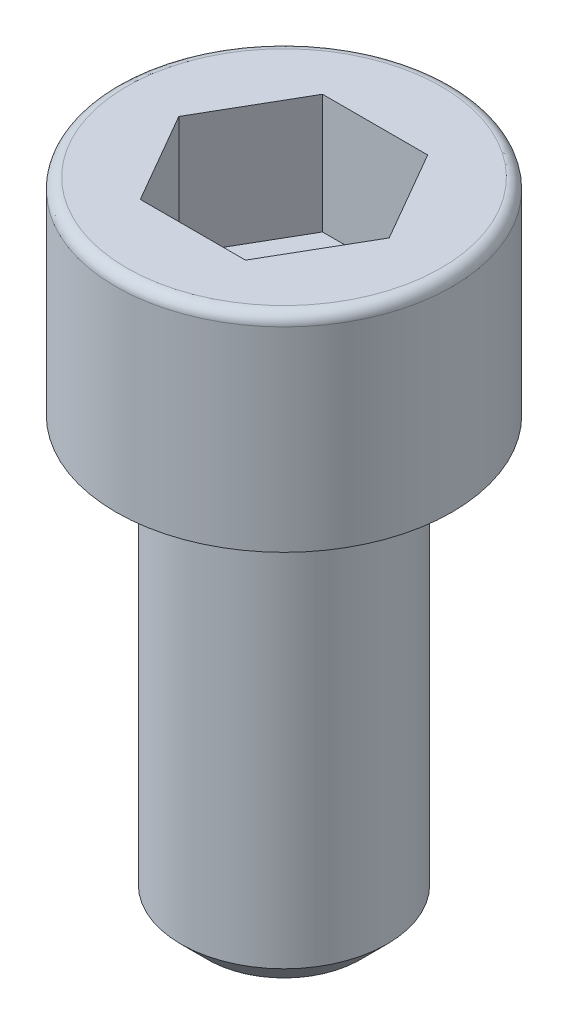
ISO-10303-21;
HEADER;
FILE_DESCRIPTION(('STEP AP214'),'2;1');
FILE_NAME('part.step','',(''),(''),'','','');
FILE_SCHEMA(('AUTOMOTIVE_DESIGN { 1 0 10303 214 1 1 1 1 }'));
ENDSEC;
DATA;
#1=APPLICATION_CONTEXT('core data for automotive mechanical design processes');
#2=APPLICATION_PROTOCOL_DEFINITION('international standard','automotive_design',2000,#1);
#3=PRODUCT_CONTEXT('',#1,'mechanical');
#4=PRODUCT('Part','Part','',(#3));
#5=PRODUCT_RELATED_PRODUCT_CATEGORY('part','',(#4));
#6=PRODUCT_DEFINITION_FORMATION('','',#4);
#7=PRODUCT_DEFINITION_CONTEXT('part definition',#1,'design');
#8=PRODUCT_DEFINITION('design','',#6,#7);
#9=PRODUCT_DEFINITION_SHAPE('','',#8);
#10=(LENGTH_UNIT() NAMED_UNIT(*) SI_UNIT(.MILLI.,.METRE.));
#11=(NAMED_UNIT(*) PLANE_ANGLE_UNIT() SI_UNIT($,.RADIAN.));
#12=(NAMED_UNIT(*) SI_UNIT($,.STERADIAN.) SOLID_ANGLE_UNIT());
#13=UNCERTAINTY_MEASURE_WITH_UNIT(LENGTH_MEASURE(1.E-05),#10,'distance_accuracy_value','');
#14=(GEOMETRIC_REPRESENTATION_CONTEXT(3) GLOBAL_UNCERTAINTY_ASSIGNED_CONTEXT((#13)) GLOBAL_UNIT_ASSIGNED_CONTEXT((#10,
#11,#12)) REPRESENTATION_CONTEXT('',''));
#15=CARTESIAN_POINT('',(0.,0.,0.));
#16=DIRECTION('',(0.,0.,1.));
#17=DIRECTION('',(1.,0.,0.));
#18=AXIS2_PLACEMENT_3D('',#15,#16,#17);
#19=CARTESIAN_POINT('',(0.,-10.,0.));
#20=DIRECTION('',(0.,1.,0.));
#21=DIRECTION('',(0.,0.,1.));
#22=AXIS2_PLACEMENT_3D('',#19,#20,#21);
#23=CYLINDRICAL_SURFACE('',#22,2.375);
#24=CARTESIAN_POINT('',(0.,0.,0.));
#25=DIRECTION('',(0.,-1.,0.));
#26=DIRECTION('',(0.,0.,-1.));
#27=AXIS2_PLACEMENT_3D('',#24,#25,#26);
#28=CIRCLE('',#27,2.375);
#29=CARTESIAN_POINT('',(0.,0.,-2.375));
#30=VERTEX_POINT('',#29);
#31=EDGE_CURVE('E11',#30,#30,#28,.T.);
#32=ORIENTED_EDGE('',*,*,#31,.T.);
#33=EDGE_LOOP('',(#32));
#34=FACE_BOUND('',#33,.T.);
#35=CARTESIAN_POINT('',(0.,-9.37500000000001,0.));
#36=DIRECTION('',(0.,-1.,0.));
#37=DIRECTION('',(0.,0.,-1.));
#38=AXIS2_PLACEMENT_3D('',#35,#36,#37);
#39=CIRCLE('',#38,2.375);
#40=CARTESIAN_POINT('',(0.,-9.37500000000001,-2.375));
#41=VERTEX_POINT('',#40);
#42=EDGE_CURVE('E206',#41,#41,#39,.T.);
#43=ORIENTED_EDGE('',*,*,#42,.F.);
#44=EDGE_LOOP('',(#43));
#45=FACE_BOUND('',#44,.T.);
#46=ADVANCED_FACE('F33',(#34,#45),#23,.T.);
#47=CARTESIAN_POINT('',(0.,4.75,0.));
#48=DIRECTION('',(0.,-1.,0.));
#49=DIRECTION('',(0.,0.,-1.));
#50=AXIS2_PLACEMENT_3D('',#47,#48,#49);
#51=CYLINDRICAL_SURFACE('',#50,3.875);
#52=CARTESIAN_POINT('',(0.,4.5,0.));
#53=DIRECTION('',(0.,1.,0.));
#54=DIRECTION('',(0.,0.,1.));
#55=AXIS2_PLACEMENT_3D('',#52,#53,#54);
#56=CIRCLE('',#55,3.875);
#57=CARTESIAN_POINT('',(0.,4.5,3.875));
#58=VERTEX_POINT('',#57);
#59=EDGE_CURVE('E37',#58,#58,#56,.F.);
#60=ORIENTED_EDGE('',*,*,#59,.T.);
#61=EDGE_LOOP('',(#60));
#62=FACE_BOUND('',#61,.T.);
#63=CARTESIAN_POINT('',(0.,0.,0.));
#64=DIRECTION('',(0.,1.,0.));
#65=DIRECTION('',(0.,0.,1.));
#66=AXIS2_PLACEMENT_3D('',#63,#64,#65);
#67=CIRCLE('',#66,3.875);
#68=CARTESIAN_POINT('',(0.,0.,3.875));
#69=VERTEX_POINT('',#68);
#70=EDGE_CURVE('E137',#69,#69,#67,.T.);
#71=ORIENTED_EDGE('',*,*,#70,.T.);
#72=EDGE_LOOP('',(#71));
#73=FACE_BOUND('',#72,.T.);
#74=ADVANCED_FACE('F151',(#62,#73),#51,.T.);
#75=CARTESIAN_POINT('',(0.,4.75,0.));
#76=DIRECTION('',(0.,1.,0.));
#77=DIRECTION('',(0.,0.,1.));
#78=AXIS2_PLACEMENT_3D('',#75,#76,#77);
#79=PLANE('',#78);
#80=DIRECTION('',(-1.,0.,0.));
#81=VECTOR('',#80,1.);
#82=CARTESIAN_POINT('',(0.,4.75,-2.1));
#83=LINE('',#82,#81);
#84=CARTESIAN_POINT('',(1.21243556529821,4.75,-2.1));
#85=VERTEX_POINT('',#84);
#86=CARTESIAN_POINT('',(-1.21243556529821,4.75,-2.1));
#87=VERTEX_POINT('',#86);
#88=EDGE_CURVE('E49',#85,#87,#83,.T.);
#89=ORIENTED_EDGE('',*,*,#88,.F.);
#90=DIRECTION('',(-0.5,0.,-0.866025403784439));
#91=VECTOR('',#90,1.);
#92=CARTESIAN_POINT('',(1.81865334794732,4.75,-1.05));
#93=LINE('',#92,#91);
#94=CARTESIAN_POINT('',(2.42487113059643,4.75,0.));
#95=VERTEX_POINT('',#94);
#96=EDGE_CURVE('E133',#95,#85,#93,.T.);
#97=ORIENTED_EDGE('',*,*,#96,.F.);
#98=DIRECTION('',(0.5,0.,-0.866025403784439));
#99=VECTOR('',#98,1.);
#100=CARTESIAN_POINT('',(1.81865334794732,4.75,1.05));
#101=LINE('',#100,#99);
#102=CARTESIAN_POINT('',(1.21243556529821,4.75,2.1));
#103=VERTEX_POINT('',#102);
#104=EDGE_CURVE('E131',#103,#95,#101,.T.);
#105=ORIENTED_EDGE('',*,*,#104,.F.);
#106=DIRECTION('',(1.,0.,0.));
#107=VECTOR('',#106,1.);
#108=CARTESIAN_POINT('',(0.,4.75,2.1));
#109=LINE('',#108,#107);
#110=CARTESIAN_POINT('',(-1.21243556529822,4.75,2.1));
#111=VERTEX_POINT('',#110);
#112=EDGE_CURVE('E97',#111,#103,#109,.T.);
#113=ORIENTED_EDGE('',*,*,#112,.F.);
#114=DIRECTION('',(0.5,0.,0.866025403784439));
#115=VECTOR('',#114,1.);
#116=CARTESIAN_POINT('',(-1.81865334794732,4.75,1.05));
#117=LINE('',#116,#115);
#118=CARTESIAN_POINT('',(-2.42487113059643,4.75,0.));
#119=VERTEX_POINT('',#118);
#120=EDGE_CURVE('E127',#119,#111,#117,.T.);
#121=ORIENTED_EDGE('',*,*,#120,.F.);
#122=DIRECTION('',(-0.5,0.,0.866025403784439));
#123=VECTOR('',#122,1.);
#124=CARTESIAN_POINT('',(-1.81865334794732,4.75,-1.05));
#125=LINE('',#124,#123);
#126=EDGE_CURVE('E123',#87,#119,#125,.T.);
#127=ORIENTED_EDGE('',*,*,#126,.F.);
#128=EDGE_LOOP('',(#89,#97,#105,#113,#121,#127));
#129=FACE_BOUND('',#128,.T.);
#130=CARTESIAN_POINT('',(0.,4.75,0.));
#131=DIRECTION('',(0.,1.,0.));
#132=DIRECTION('',(0.,0.,1.));
#133=AXIS2_PLACEMENT_3D('',#130,#131,#132);
#134=CIRCLE('',#133,3.625);
#135=CARTESIAN_POINT('',(0.,4.75,3.625));
#136=VERTEX_POINT('',#135);
#137=EDGE_CURVE('E144',#136,#136,#134,.T.);
#138=ORIENTED_EDGE('',*,*,#137,.T.);
#139=EDGE_LOOP('',(#138));
#140=FACE_BOUND('',#139,.T.);
#141=ADVANCED_FACE('F164',(#129,#140),#79,.T.);
#142=CARTESIAN_POINT('',(0.,0.,0.));
#143=DIRECTION('',(0.,1.,0.));
#144=DIRECTION('',(0.,0.,1.));
#145=AXIS2_PLACEMENT_3D('',#142,#143,#144);
#146=PLANE('',#145);
#147=ORIENTED_EDGE('',*,*,#31,.F.);
#148=EDGE_LOOP('',(#147));
#149=FACE_BOUND('',#148,.T.);
#150=ORIENTED_EDGE('',*,*,#70,.F.);
#151=EDGE_LOOP('',(#150));
#152=FACE_BOUND('',#151,.T.);
#153=ADVANCED_FACE('F157',(#149,#152),#146,.F.);
#154=CARTESIAN_POINT('',(0.,4.5,0.));
#155=DIRECTION('',(0.,1.,0.));
#156=DIRECTION('',(0.,0.,1.));
#157=AXIS2_PLACEMENT_3D('',#154,#155,#156);
#158=TOROIDAL_SURFACE('',#157,3.625,0.25);
#159=ORIENTED_EDGE('',*,*,#59,.F.);
#160=EDGE_LOOP('',(#159));
#161=FACE_BOUND('',#160,.T.);
#162=ORIENTED_EDGE('',*,*,#137,.F.);
#163=EDGE_LOOP('',(#162));
#164=FACE_BOUND('',#163,.T.);
#165=ADVANCED_FACE('F35',(#161,#164),#158,.T.);
#166=CARTESIAN_POINT('',(0.,2.,-2.1));
#167=DIRECTION('',(0.,0.,-1.));
#168=DIRECTION('',(-1.,0.,0.));
#169=AXIS2_PLACEMENT_3D('',#166,#167,#168);
#170=PLANE('',#169);
#171=ORIENTED_EDGE('',*,*,#88,.T.);
#172=DIRECTION('',(0.,1.,0.));
#173=VECTOR('',#172,1.);
#174=CARTESIAN_POINT('',(-1.21243556529821,2.,-2.1));
#175=LINE('',#174,#173);
#176=CARTESIAN_POINT('',(-1.21243556529821,2.,-2.1));
#177=VERTEX_POINT('',#176);
#178=EDGE_CURVE('E79',#177,#87,#175,.T.);
#179=ORIENTED_EDGE('',*,*,#178,.F.);
#180=DIRECTION('',(-1.,0.,0.));
#181=VECTOR('',#180,1.);
#182=CARTESIAN_POINT('',(0.,2.,-2.1));
#183=LINE('',#182,#181);
#184=CARTESIAN_POINT('',(1.21243556529821,2.,-2.1));
#185=VERTEX_POINT('',#184);
#186=EDGE_CURVE('E135',#185,#177,#183,.T.);
#187=ORIENTED_EDGE('',*,*,#186,.F.);
#188=DIRECTION('',(0.,1.,0.));
#189=VECTOR('',#188,1.);
#190=CARTESIAN_POINT('',(1.21243556529821,2.,-2.1));
#191=LINE('',#190,#189);
#192=EDGE_CURVE('E57',#185,#85,#191,.T.);
#193=ORIENTED_EDGE('',*,*,#192,.T.);
#194=EDGE_LOOP('',(#171,#179,#187,#193));
#195=FACE_BOUND('',#194,.T.);
#196=ADVANCED_FACE('F156',(#195),#170,.F.);
#197=CARTESIAN_POINT('',(1.81865334794732,2.,-1.05));
#198=DIRECTION('',(0.866025403784439,0.,-0.5));
#199=DIRECTION('',(-0.5,0.,-0.866025403784439));
#200=AXIS2_PLACEMENT_3D('',#197,#198,#199);
#201=PLANE('',#200);
#202=ORIENTED_EDGE('',*,*,#96,.T.);
#203=ORIENTED_EDGE('',*,*,#192,.F.);
#204=DIRECTION('',(-0.5,0.,-0.866025403784439));
#205=VECTOR('',#204,1.);
#206=CARTESIAN_POINT('',(1.81865334794732,2.,-1.05));
#207=LINE('',#206,#205);
#208=CARTESIAN_POINT('',(2.42487113059643,2.,0.));
#209=VERTEX_POINT('',#208);
#210=EDGE_CURVE('E109',#209,#185,#207,.T.);
#211=ORIENTED_EDGE('',*,*,#210,.F.);
#212=DIRECTION('',(0.,1.,0.));
#213=VECTOR('',#212,1.);
#214=CARTESIAN_POINT('',(2.42487113059643,2.,0.));
#215=LINE('',#214,#213);
#216=EDGE_CURVE('E101',#209,#95,#215,.T.);
#217=ORIENTED_EDGE('',*,*,#216,.T.);
#218=EDGE_LOOP('',(#202,#203,#211,#217));
#219=FACE_BOUND('',#218,.T.);
#220=ADVANCED_FACE('F162',(#219),#201,.F.);
#221=CARTESIAN_POINT('',(1.81865334794732,2.,1.05));
#222=DIRECTION('',(0.866025403784439,0.,0.5));
#223=DIRECTION('',(0.5,0.,-0.866025403784439));
#224=AXIS2_PLACEMENT_3D('',#221,#222,#223);
#225=PLANE('',#224);
#226=ORIENTED_EDGE('',*,*,#104,.T.);
#227=ORIENTED_EDGE('',*,*,#216,.F.);
#228=DIRECTION('',(0.5,0.,-0.866025403784439));
#229=VECTOR('',#228,1.);
#230=CARTESIAN_POINT('',(1.81865334794732,2.,1.05));
#231=LINE('',#230,#229);
#232=CARTESIAN_POINT('',(1.21243556529821,2.,2.1));
#233=VERTEX_POINT('',#232);
#234=EDGE_CURVE('E105',#233,#209,#231,.T.);
#235=ORIENTED_EDGE('',*,*,#234,.F.);
#236=DIRECTION('',(0.,1.,0.));
#237=VECTOR('',#236,1.);
#238=CARTESIAN_POINT('',(1.21243556529821,2.,2.1));
#239=LINE('',#238,#237);
#240=EDGE_CURVE('E90',#233,#103,#239,.T.);
#241=ORIENTED_EDGE('',*,*,#240,.T.);
#242=EDGE_LOOP('',(#226,#227,#235,#241));
#243=FACE_BOUND('',#242,.T.);
#244=ADVANCED_FACE('F106',(#243),#225,.F.);
#245=CARTESIAN_POINT('',(0.,2.,2.1));
#246=DIRECTION('',(0.,0.,1.));
#247=DIRECTION('',(1.,0.,0.));
#248=AXIS2_PLACEMENT_3D('',#245,#246,#247);
#249=PLANE('',#248);
#250=ORIENTED_EDGE('',*,*,#112,.T.);
#251=ORIENTED_EDGE('',*,*,#240,.F.);
#252=DIRECTION('',(1.,0.,0.));
#253=VECTOR('',#252,1.);
#254=CARTESIAN_POINT('',(0.,2.,2.1));
#255=LINE('',#254,#253);
#256=CARTESIAN_POINT('',(-1.21243556529822,2.,2.1));
#257=VERTEX_POINT('',#256);
#258=EDGE_CURVE('E94',#257,#233,#255,.T.);
#259=ORIENTED_EDGE('',*,*,#258,.F.);
#260=DIRECTION('',(0.,1.,0.));
#261=VECTOR('',#260,1.);
#262=CARTESIAN_POINT('',(-1.21243556529822,2.,2.1));
#263=LINE('',#262,#261);
#264=EDGE_CURVE('E102',#257,#111,#263,.T.);
#265=ORIENTED_EDGE('',*,*,#264,.T.);
#266=EDGE_LOOP('',(#250,#251,#259,#265));
#267=FACE_BOUND('',#266,.T.);
#268=ADVANCED_FACE('F92',(#267),#249,.F.);
#269=CARTESIAN_POINT('',(-1.81865334794732,2.,1.05));
#270=DIRECTION('',(-0.866025403784439,0.,0.5));
#271=DIRECTION('',(0.5,0.,0.866025403784439));
#272=AXIS2_PLACEMENT_3D('',#269,#270,#271);
#273=PLANE('',#272);
#274=ORIENTED_EDGE('',*,*,#120,.T.);
#275=ORIENTED_EDGE('',*,*,#264,.F.);
#276=DIRECTION('',(0.5,0.,0.866025403784439));
#277=VECTOR('',#276,1.);
#278=CARTESIAN_POINT('',(-1.81865334794732,2.,1.05));
#279=LINE('',#278,#277);
#280=CARTESIAN_POINT('',(-2.42487113059643,2.,0.));
#281=VERTEX_POINT('',#280);
#282=EDGE_CURVE('E115',#281,#257,#279,.T.);
#283=ORIENTED_EDGE('',*,*,#282,.F.);
#284=DIRECTION('',(0.,1.,0.));
#285=VECTOR('',#284,1.);
#286=CARTESIAN_POINT('',(-2.42487113059643,2.,0.));
#287=LINE('',#286,#285);
#288=EDGE_CURVE('E140',#281,#119,#287,.T.);
#289=ORIENTED_EDGE('',*,*,#288,.T.);
#290=EDGE_LOOP('',(#274,#275,#283,#289));
#291=FACE_BOUND('',#290,.T.);
#292=ADVANCED_FACE('F188',(#291),#273,.F.);
#293=CARTESIAN_POINT('',(-1.81865334794732,2.,-1.05));
#294=DIRECTION('',(-0.866025403784439,0.,-0.5));
#295=DIRECTION('',(-0.5,0.,0.866025403784439));
#296=AXIS2_PLACEMENT_3D('',#293,#294,#295);
#297=PLANE('',#296);
#298=ORIENTED_EDGE('',*,*,#126,.T.);
#299=ORIENTED_EDGE('',*,*,#288,.F.);
#300=DIRECTION('',(-0.5,0.,0.866025403784439));
#301=VECTOR('',#300,1.);
#302=CARTESIAN_POINT('',(-1.81865334794732,2.,-1.05));
#303=LINE('',#302,#301);
#304=EDGE_CURVE('E117',#177,#281,#303,.T.);
#305=ORIENTED_EDGE('',*,*,#304,.F.);
#306=ORIENTED_EDGE('',*,*,#178,.T.);
#307=EDGE_LOOP('',(#298,#299,#305,#306));
#308=FACE_BOUND('',#307,.T.);
#309=ADVANCED_FACE('F181',(#308),#297,.F.);
#310=CARTESIAN_POINT('',(0.,2.,0.));
#311=DIRECTION('',(0.,1.,0.));
#312=DIRECTION('',(0.,0.,1.));
#313=AXIS2_PLACEMENT_3D('',#310,#311,#312);
#314=PLANE('',#313);
#315=ORIENTED_EDGE('',*,*,#186,.T.);
#316=ORIENTED_EDGE('',*,*,#304,.T.);
#317=ORIENTED_EDGE('',*,*,#282,.T.);
#318=ORIENTED_EDGE('',*,*,#258,.T.);
#319=ORIENTED_EDGE('',*,*,#234,.T.);
#320=ORIENTED_EDGE('',*,*,#210,.T.);
#321=EDGE_LOOP('',(#315,#316,#317,#318,#319,#320));
#322=FACE_BOUND('',#321,.T.);
#323=ADVANCED_FACE('F112',(#322),#314,.T.);
#324=CARTESIAN_POINT('',(0.,-10.,0.));
#325=DIRECTION('',(0.,1.,0.));
#326=DIRECTION('',(0.,0.,1.));
#327=AXIS2_PLACEMENT_3D('',#324,#325,#326);
#328=CONICAL_SURFACE('',#327,1.75,0.785398163397455);
#329=ORIENTED_EDGE('',*,*,#42,.T.);
#330=EDGE_LOOP('',(#329));
#331=FACE_BOUND('',#330,.T.);
#332=CARTESIAN_POINT('',(0.,-10.,0.));
#333=DIRECTION('',(0.,-1.,0.));
#334=DIRECTION('',(0.,0.,-1.));
#335=AXIS2_PLACEMENT_3D('',#332,#333,#334);
#336=CIRCLE('',#335,1.75);
#337=CARTESIAN_POINT('',(0.,-10.,-1.75));
#338=VERTEX_POINT('',#337);
#339=EDGE_CURVE('E124',#338,#338,#336,.T.);
#340=ORIENTED_EDGE('',*,*,#339,.F.);
#341=EDGE_LOOP('',(#340));
#342=FACE_BOUND('',#341,.T.);
#343=ADVANCED_FACE('F180',(#331,#342),#328,.T.);
#344=CARTESIAN_POINT('',(0.,-10.,0.));
#345=DIRECTION('',(0.,-1.,0.));
#346=DIRECTION('',(0.,0.,-1.));
#347=AXIS2_PLACEMENT_3D('',#344,#345,#346);
#348=PLANE('',#347);
#349=ORIENTED_EDGE('',*,*,#339,.T.);
#350=EDGE_LOOP('',(#349));
#351=FACE_BOUND('',#350,.T.);
#352=ADVANCED_FACE('F176',(#351),#348,.T.);
#353=CLOSED_SHELL('',(#46,#74,#141,#153,#165,#196,#220,#244,#268,#292,#309,#323,#343,#352));
#354=MANIFOLD_SOLID_BREP('B2',#353);
#355=ADVANCED_BREP_SHAPE_REPRESENTATION('',(#18,#354),#14);
#356=SHAPE_DEFINITION_REPRESENTATION(#9,#355);
ENDSEC;
END-ISO-10303-21;
